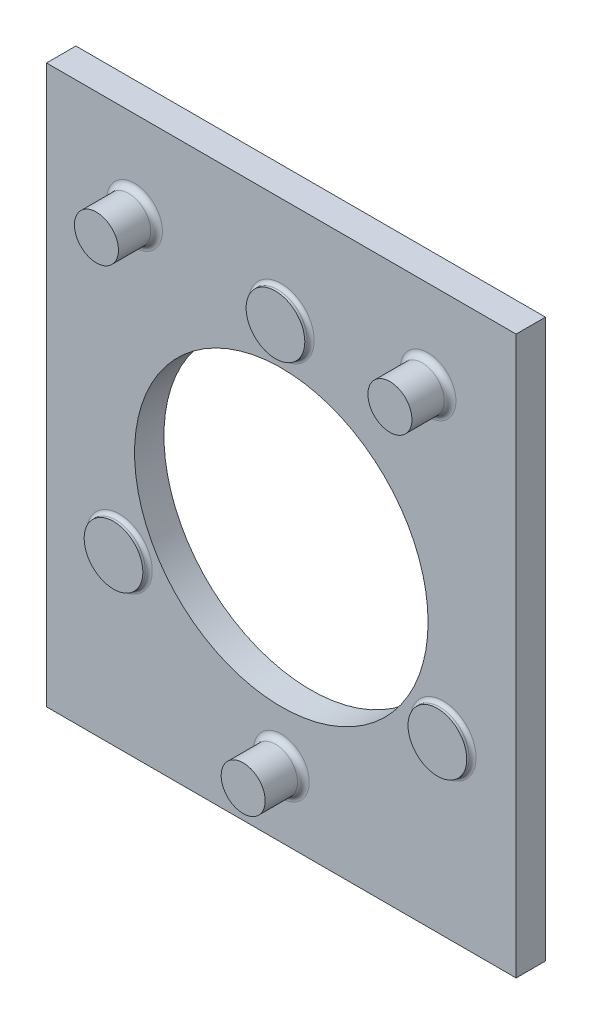
ISO-10303-21;
HEADER;
FILE_DESCRIPTION(('STEP AP214'),'2;1');
FILE_NAME('part.step','',(''),(''),'','','');
FILE_SCHEMA(('AUTOMOTIVE_DESIGN { 1 0 10303 214 1 1 1 1 }'));
ENDSEC;
DATA;
#1=APPLICATION_CONTEXT('core data for automotive mechanical design processes');
#2=APPLICATION_PROTOCOL_DEFINITION('international standard','automotive_design',2000,#1);
#3=PRODUCT_CONTEXT('',#1,'mechanical');
#4=PRODUCT('Part','Part','',(#3));
#5=PRODUCT_RELATED_PRODUCT_CATEGORY('part','',(#4));
#6=PRODUCT_DEFINITION_FORMATION('','',#4);
#7=PRODUCT_DEFINITION_CONTEXT('part definition',#1,'design');
#8=PRODUCT_DEFINITION('design','',#6,#7);
#9=PRODUCT_DEFINITION_SHAPE('','',#8);
#10=(LENGTH_UNIT() NAMED_UNIT(*) SI_UNIT(.MILLI.,.METRE.));
#11=(NAMED_UNIT(*) PLANE_ANGLE_UNIT() SI_UNIT($,.RADIAN.));
#12=(NAMED_UNIT(*) SI_UNIT($,.STERADIAN.) SOLID_ANGLE_UNIT());
#13=UNCERTAINTY_MEASURE_WITH_UNIT(LENGTH_MEASURE(1.E-05),#10,'distance_accuracy_value','');
#14=(GEOMETRIC_REPRESENTATION_CONTEXT(3) GLOBAL_UNCERTAINTY_ASSIGNED_CONTEXT((#13)) GLOBAL_UNIT_ASSIGNED_CONTEXT((#10,
#11,#12)) REPRESENTATION_CONTEXT('',''));
#15=CARTESIAN_POINT('',(0.,0.,0.));
#16=DIRECTION('',(0.,0.,1.));
#17=DIRECTION('',(1.,0.,0.));
#18=AXIS2_PLACEMENT_3D('',#15,#16,#17);
#19=CARTESIAN_POINT('',(0.,241.3,12.7));
#20=DIRECTION('',(0.,0.,-1.));
#21=DIRECTION('',(-1.,0.,0.));
#22=AXIS2_PLACEMENT_3D('',#19,#20,#21);
#23=PLANE('',#22);
#24=CARTESIAN_POINT('',(101.6,195.212789493481,12.7));
#25=DIRECTION('',(0.,0.,-1.));
#26=DIRECTION('',(-1.,0.,0.));
#27=AXIS2_PLACEMENT_3D('',#24,#25,#26);
#28=CIRCLE('',#27,14.224);
#29=CARTESIAN_POINT('',(87.376,195.212789493481,12.7));
#30=VERTEX_POINT('',#29);
#31=EDGE_CURVE('E138',#30,#30,#28,.T.);
#32=ORIENTED_EDGE('',*,*,#31,.T.);
#33=EDGE_LOOP('',(#32));
#34=FACE_BOUND('',#33,.T.);
#35=CARTESIAN_POINT('',(171.672531192417,73.8436052532595,12.7));
#36=DIRECTION('',(0.,0.,-1.));
#37=DIRECTION('',(-1.,0.,0.));
#38=AXIS2_PLACEMENT_3D('',#35,#36,#37);
#39=CIRCLE('',#38,14.224);
#40=CARTESIAN_POINT('',(157.448531192417,73.8436052532595,12.7));
#41=VERTEX_POINT('',#40);
#42=EDGE_CURVE('E135',#41,#41,#39,.T.);
#43=ORIENTED_EDGE('',*,*,#42,.T.);
#44=EDGE_LOOP('',(#43));
#45=FACE_BOUND('',#44,.T.);
#46=CARTESIAN_POINT('',(31.527468807583,73.8436052532596,12.7));
#47=DIRECTION('',(0.,0.,-1.));
#48=DIRECTION('',(-1.,0.,0.));
#49=AXIS2_PLACEMENT_3D('',#46,#47,#48);
#50=CIRCLE('',#49,14.224);
#51=CARTESIAN_POINT('',(17.303468807583,73.8436052532596,12.7));
#52=VERTEX_POINT('',#51);
#53=EDGE_CURVE('E132',#52,#52,#50,.T.);
#54=ORIENTED_EDGE('',*,*,#53,.T.);
#55=EDGE_LOOP('',(#54));
#56=FACE_BOUND('',#55,.T.);
#57=CARTESIAN_POINT('',(38.1,203.2,12.7));
#58=DIRECTION('',(0.,0.,-1.));
#59=DIRECTION('',(-1.,0.,0.));
#60=AXIS2_PLACEMENT_3D('',#57,#58,#59);
#61=CIRCLE('',#60,12.065);
#62=CARTESIAN_POINT('',(26.035,203.2,12.7));
#63=VERTEX_POINT('',#62);
#64=EDGE_CURVE('E120',#63,#63,#61,.T.);
#65=ORIENTED_EDGE('',*,*,#64,.T.);
#66=EDGE_LOOP('',(#65));
#67=FACE_BOUND('',#66,.T.);
#68=CARTESIAN_POINT('',(165.1,203.2,12.7));
#69=DIRECTION('',(0.,0.,-1.));
#70=DIRECTION('',(-1.,0.,0.));
#71=AXIS2_PLACEMENT_3D('',#68,#69,#70);
#72=CIRCLE('',#71,12.065);
#73=CARTESIAN_POINT('',(153.035,203.2,12.7));
#74=VERTEX_POINT('',#73);
#75=EDGE_CURVE('E117',#74,#74,#72,.T.);
#76=ORIENTED_EDGE('',*,*,#75,.T.);
#77=EDGE_LOOP('',(#76));
#78=FACE_BOUND('',#77,.T.);
#79=CARTESIAN_POINT('',(101.6,28.575,12.7));
#80=DIRECTION('',(0.,0.,-1.));
#81=DIRECTION('',(-1.,0.,0.));
#82=AXIS2_PLACEMENT_3D('',#79,#80,#81);
#83=CIRCLE('',#82,12.065);
#84=CARTESIAN_POINT('',(89.535,28.575,12.7));
#85=VERTEX_POINT('',#84);
#86=EDGE_CURVE('E114',#85,#85,#83,.T.);
#87=ORIENTED_EDGE('',*,*,#86,.T.);
#88=EDGE_LOOP('',(#87));
#89=FACE_BOUND('',#88,.T.);
#90=DIRECTION('',(0.,-1.,0.));
#91=VECTOR('',#90,1.);
#92=CARTESIAN_POINT('',(0.,0.,12.7));
#93=LINE('',#92,#91);
#94=CARTESIAN_POINT('',(0.,241.3,12.7));
#95=VERTEX_POINT('',#94);
#96=CARTESIAN_POINT('',(0.,0.,12.7));
#97=VERTEX_POINT('',#96);
#98=EDGE_CURVE('E86',#95,#97,#93,.T.);
#99=ORIENTED_EDGE('',*,*,#98,.T.);
#100=DIRECTION('',(1.,0.,0.));
#101=VECTOR('',#100,1.);
#102=CARTESIAN_POINT('',(0.,0.,12.7));
#103=LINE('',#102,#101);
#104=CARTESIAN_POINT('',(203.2,0.,12.7));
#105=VERTEX_POINT('',#104);
#106=EDGE_CURVE('E81',#97,#105,#103,.T.);
#107=ORIENTED_EDGE('',*,*,#106,.T.);
#108=DIRECTION('',(0.,1.,0.));
#109=VECTOR('',#108,1.);
#110=CARTESIAN_POINT('',(203.2,0.,12.7));
#111=LINE('',#110,#109);
#112=CARTESIAN_POINT('',(203.2,241.3,12.7));
#113=VERTEX_POINT('',#112);
#114=EDGE_CURVE('E84',#105,#113,#111,.T.);
#115=ORIENTED_EDGE('',*,*,#114,.T.);
#116=DIRECTION('',(-1.,0.,0.));
#117=VECTOR('',#116,1.);
#118=CARTESIAN_POINT('',(0.,241.3,12.7));
#119=LINE('',#118,#117);
#120=EDGE_CURVE('E50',#113,#95,#119,.T.);
#121=ORIENTED_EDGE('',*,*,#120,.T.);
#122=EDGE_LOOP('',(#99,#107,#115,#121));
#123=FACE_BOUND('',#122,.T.);
#124=CARTESIAN_POINT('',(101.6,114.3,12.7));
#125=DIRECTION('',(0.,0.,1.));
#126=DIRECTION('',(1.,0.,0.));
#127=AXIS2_PLACEMENT_3D('',#124,#125,#126);
#128=CIRCLE('',#127,63.5);
#129=CARTESIAN_POINT('',(165.1,114.3,12.7));
#130=VERTEX_POINT('',#129);
#131=EDGE_CURVE('E104',#130,#130,#128,.T.);
#132=ORIENTED_EDGE('',*,*,#131,.F.);
#133=EDGE_LOOP('',(#132));
#134=FACE_BOUND('',#133,.T.);
#135=ADVANCED_FACE('F33',(#34,#45,#56,#67,#78,#89,#123,#134),#23,.F.);
#136=CARTESIAN_POINT('',(0.,241.3,0.));
#137=DIRECTION('',(0.,0.,-1.));
#138=DIRECTION('',(-1.,0.,0.));
#139=AXIS2_PLACEMENT_3D('',#136,#137,#138);
#140=PLANE('',#139);
#141=DIRECTION('',(0.,-1.,0.));
#142=VECTOR('',#141,1.);
#143=CARTESIAN_POINT('',(0.,0.,0.));
#144=LINE('',#143,#142);
#145=CARTESIAN_POINT('',(0.,241.3,0.));
#146=VERTEX_POINT('',#145);
#147=CARTESIAN_POINT('',(0.,0.,0.));
#148=VERTEX_POINT('',#147);
#149=EDGE_CURVE('E101',#146,#148,#144,.T.);
#150=ORIENTED_EDGE('',*,*,#149,.F.);
#151=DIRECTION('',(-1.,0.,0.));
#152=VECTOR('',#151,1.);
#153=CARTESIAN_POINT('',(0.,241.3,0.));
#154=LINE('',#153,#152);
#155=CARTESIAN_POINT('',(203.2,241.3,0.));
#156=VERTEX_POINT('',#155);
#157=EDGE_CURVE('E73',#156,#146,#154,.T.);
#158=ORIENTED_EDGE('',*,*,#157,.F.);
#159=DIRECTION('',(0.,1.,0.));
#160=VECTOR('',#159,1.);
#161=CARTESIAN_POINT('',(203.2,0.,0.));
#162=LINE('',#161,#160);
#163=CARTESIAN_POINT('',(203.2,0.,0.));
#164=VERTEX_POINT('',#163);
#165=EDGE_CURVE('E67',#164,#156,#162,.T.);
#166=ORIENTED_EDGE('',*,*,#165,.F.);
#167=DIRECTION('',(1.,0.,0.));
#168=VECTOR('',#167,1.);
#169=CARTESIAN_POINT('',(0.,0.,0.));
#170=LINE('',#169,#168);
#171=EDGE_CURVE('E91',#148,#164,#170,.T.);
#172=ORIENTED_EDGE('',*,*,#171,.F.);
#173=EDGE_LOOP('',(#150,#158,#166,#172));
#174=FACE_BOUND('',#173,.T.);
#175=CARTESIAN_POINT('',(101.6,114.3,0.));
#176=DIRECTION('',(0.,0.,1.));
#177=DIRECTION('',(1.,0.,0.));
#178=AXIS2_PLACEMENT_3D('',#175,#176,#177);
#179=CIRCLE('',#178,63.5);
#180=CARTESIAN_POINT('',(165.1,114.3,0.));
#181=VERTEX_POINT('',#180);
#182=EDGE_CURVE('E227',#181,#181,#179,.T.);
#183=ORIENTED_EDGE('',*,*,#182,.T.);
#184=EDGE_LOOP('',(#183));
#185=FACE_BOUND('',#184,.T.);
#186=ADVANCED_FACE('F160',(#174,#185),#140,.T.);
#187=CARTESIAN_POINT('',(0.,0.,12.7));
#188=DIRECTION('',(1.,0.,0.));
#189=DIRECTION('',(0.,0.,-1.));
#190=AXIS2_PLACEMENT_3D('',#187,#188,#189);
#191=PLANE('',#190);
#192=ORIENTED_EDGE('',*,*,#149,.T.);
#193=DIRECTION('',(0.,0.,-1.));
#194=VECTOR('',#193,1.);
#195=CARTESIAN_POINT('',(0.,0.,12.7));
#196=LINE('',#195,#194);
#197=EDGE_CURVE('E92',#97,#148,#196,.T.);
#198=ORIENTED_EDGE('',*,*,#197,.F.);
#199=ORIENTED_EDGE('',*,*,#98,.F.);
#200=DIRECTION('',(0.,0.,-1.));
#201=VECTOR('',#200,1.);
#202=CARTESIAN_POINT('',(0.,241.3,12.7));
#203=LINE('',#202,#201);
#204=EDGE_CURVE('E97',#95,#146,#203,.T.);
#205=ORIENTED_EDGE('',*,*,#204,.T.);
#206=EDGE_LOOP('',(#192,#198,#199,#205));
#207=FACE_BOUND('',#206,.T.);
#208=ADVANCED_FACE('F166',(#207),#191,.F.);
#209=CARTESIAN_POINT('',(0.,0.,12.7));
#210=DIRECTION('',(0.,1.,0.));
#211=DIRECTION('',(0.,0.,1.));
#212=AXIS2_PLACEMENT_3D('',#209,#210,#211);
#213=PLANE('',#212);
#214=ORIENTED_EDGE('',*,*,#171,.T.);
#215=DIRECTION('',(0.,0.,-1.));
#216=VECTOR('',#215,1.);
#217=CARTESIAN_POINT('',(203.2,0.,12.7));
#218=LINE('',#217,#216);
#219=EDGE_CURVE('E89',#105,#164,#218,.T.);
#220=ORIENTED_EDGE('',*,*,#219,.F.);
#221=ORIENTED_EDGE('',*,*,#106,.F.);
#222=ORIENTED_EDGE('',*,*,#197,.T.);
#223=EDGE_LOOP('',(#214,#220,#221,#222));
#224=FACE_BOUND('',#223,.T.);
#225=ADVANCED_FACE('F90',(#224),#213,.F.);
#226=CARTESIAN_POINT('',(203.2,0.,12.7));
#227=DIRECTION('',(-1.,0.,0.));
#228=DIRECTION('',(0.,0.,1.));
#229=AXIS2_PLACEMENT_3D('',#226,#227,#228);
#230=PLANE('',#229);
#231=ORIENTED_EDGE('',*,*,#165,.T.);
#232=DIRECTION('',(0.,0.,-1.));
#233=VECTOR('',#232,1.);
#234=CARTESIAN_POINT('',(203.2,241.3,12.7));
#235=LINE('',#234,#233);
#236=EDGE_CURVE('E93',#113,#156,#235,.T.);
#237=ORIENTED_EDGE('',*,*,#236,.F.);
#238=ORIENTED_EDGE('',*,*,#114,.F.);
#239=ORIENTED_EDGE('',*,*,#219,.T.);
#240=EDGE_LOOP('',(#231,#237,#238,#239));
#241=FACE_BOUND('',#240,.T.);
#242=ADVANCED_FACE('F95',(#241),#230,.F.);
#243=CARTESIAN_POINT('',(0.,241.3,12.7));
#244=DIRECTION('',(0.,-1.,0.));
#245=DIRECTION('',(0.,0.,-1.));
#246=AXIS2_PLACEMENT_3D('',#243,#244,#245);
#247=PLANE('',#246);
#248=ORIENTED_EDGE('',*,*,#157,.T.);
#249=ORIENTED_EDGE('',*,*,#204,.F.);
#250=ORIENTED_EDGE('',*,*,#120,.F.);
#251=ORIENTED_EDGE('',*,*,#236,.T.);
#252=EDGE_LOOP('',(#248,#249,#250,#251));
#253=FACE_BOUND('',#252,.T.);
#254=ADVANCED_FACE('F174',(#253),#247,.F.);
#255=CARTESIAN_POINT('',(101.6,114.3,12.7));
#256=DIRECTION('',(0.,0.,-1.));
#257=DIRECTION('',(-1.,0.,0.));
#258=AXIS2_PLACEMENT_3D('',#255,#256,#257);
#259=CYLINDRICAL_SURFACE('',#258,63.5);
#260=ORIENTED_EDGE('',*,*,#131,.T.);
#261=EDGE_LOOP('',(#260));
#262=FACE_BOUND('',#261,.T.);
#263=ORIENTED_EDGE('',*,*,#182,.F.);
#264=EDGE_LOOP('',(#263));
#265=FACE_BOUND('',#264,.T.);
#266=ADVANCED_FACE('F171',(#262,#265),#259,.F.);
#267=CARTESIAN_POINT('',(31.527468807583,73.8436052532596,15.24));
#268=DIRECTION('',(0.,0.,-1.));
#269=DIRECTION('',(-1.,0.,0.));
#270=AXIS2_PLACEMENT_3D('',#267,#268,#269);
#271=CYLINDRICAL_SURFACE('',#270,12.7);
#272=CARTESIAN_POINT('',(31.527468807583,73.8436052532596,14.224));
#273=DIRECTION('',(0.,0.,-1.));
#274=DIRECTION('',(-1.,0.,0.));
#275=AXIS2_PLACEMENT_3D('',#272,#273,#274);
#276=CIRCLE('',#275,12.7);
#277=CARTESIAN_POINT('',(18.827468807583,73.8436052532596,14.224));
#278=VERTEX_POINT('',#277);
#279=EDGE_CURVE('E11',#278,#278,#276,.F.);
#280=ORIENTED_EDGE('',*,*,#279,.T.);
#281=EDGE_LOOP('',(#280));
#282=FACE_BOUND('',#281,.T.);
#283=CARTESIAN_POINT('',(31.527468807583,73.8436052532596,15.24));
#284=DIRECTION('',(0.,0.,1.));
#285=DIRECTION('',(1.,0.,0.));
#286=AXIS2_PLACEMENT_3D('',#283,#284,#285);
#287=CIRCLE('',#286,12.7);
#288=CARTESIAN_POINT('',(44.227468807583,73.8436052532596,15.24));
#289=VERTEX_POINT('',#288);
#290=EDGE_CURVE('E224',#289,#289,#287,.T.);
#291=ORIENTED_EDGE('',*,*,#290,.F.);
#292=EDGE_LOOP('',(#291));
#293=FACE_BOUND('',#292,.T.);
#294=ADVANCED_FACE('F235',(#282,#293),#271,.T.);
#295=CARTESIAN_POINT('',(31.527468807583,73.8436052532596,15.24));
#296=DIRECTION('',(0.,0.,1.));
#297=DIRECTION('',(1.,0.,0.));
#298=AXIS2_PLACEMENT_3D('',#295,#296,#297);
#299=PLANE('',#298);
#300=ORIENTED_EDGE('',*,*,#290,.T.);
#301=EDGE_LOOP('',(#300));
#302=FACE_BOUND('',#301,.T.);
#303=ADVANCED_FACE('F240',(#302),#299,.T.);
#304=CARTESIAN_POINT('',(101.6,195.212789493481,15.24));
#305=DIRECTION('',(0.,0.,-1.));
#306=DIRECTION('',(-1.,0.,0.));
#307=AXIS2_PLACEMENT_3D('',#304,#305,#306);
#308=CYLINDRICAL_SURFACE('',#307,12.7);
#309=CARTESIAN_POINT('',(101.6,195.212789493481,14.224));
#310=DIRECTION('',(0.,0.,-1.));
#311=DIRECTION('',(-1.,0.,0.));
#312=AXIS2_PLACEMENT_3D('',#309,#310,#311);
#313=CIRCLE('',#312,12.7);
#314=CARTESIAN_POINT('',(88.9,195.212789493481,14.224));
#315=VERTEX_POINT('',#314);
#316=EDGE_CURVE('E129',#315,#315,#313,.F.);
#317=ORIENTED_EDGE('',*,*,#316,.T.);
#318=EDGE_LOOP('',(#317));
#319=FACE_BOUND('',#318,.T.);
#320=CARTESIAN_POINT('',(101.6,195.212789493481,15.24));
#321=DIRECTION('',(0.,0.,1.));
#322=DIRECTION('',(1.,0.,0.));
#323=AXIS2_PLACEMENT_3D('',#320,#321,#322);
#324=CIRCLE('',#323,12.7);
#325=CARTESIAN_POINT('',(114.3,195.212789493481,15.24));
#326=VERTEX_POINT('',#325);
#327=EDGE_CURVE('E221',#326,#326,#324,.T.);
#328=ORIENTED_EDGE('',*,*,#327,.F.);
#329=EDGE_LOOP('',(#328));
#330=FACE_BOUND('',#329,.T.);
#331=ADVANCED_FACE('F246',(#319,#330),#308,.T.);
#332=CARTESIAN_POINT('',(101.6,195.212789493481,15.24));
#333=DIRECTION('',(0.,0.,1.));
#334=DIRECTION('',(1.,0.,0.));
#335=AXIS2_PLACEMENT_3D('',#332,#333,#334);
#336=PLANE('',#335);
#337=ORIENTED_EDGE('',*,*,#327,.T.);
#338=EDGE_LOOP('',(#337));
#339=FACE_BOUND('',#338,.T.);
#340=ADVANCED_FACE('F253',(#339),#336,.T.);
#341=CARTESIAN_POINT('',(171.672531192417,73.8436052532595,15.24));
#342=DIRECTION('',(0.,0.,-1.));
#343=DIRECTION('',(-1.,0.,0.));
#344=AXIS2_PLACEMENT_3D('',#341,#342,#343);
#345=CYLINDRICAL_SURFACE('',#344,12.7);
#346=CARTESIAN_POINT('',(171.672531192417,73.8436052532595,14.224));
#347=DIRECTION('',(0.,0.,-1.));
#348=DIRECTION('',(-1.,0.,0.));
#349=AXIS2_PLACEMENT_3D('',#346,#347,#348);
#350=CIRCLE('',#349,12.7);
#351=CARTESIAN_POINT('',(158.972531192417,73.8436052532595,14.224));
#352=VERTEX_POINT('',#351);
#353=EDGE_CURVE('E42',#352,#352,#350,.F.);
#354=ORIENTED_EDGE('',*,*,#353,.T.);
#355=EDGE_LOOP('',(#354));
#356=FACE_BOUND('',#355,.T.);
#357=CARTESIAN_POINT('',(171.672531192417,73.8436052532595,15.24));
#358=DIRECTION('',(0.,0.,1.));
#359=DIRECTION('',(1.,0.,0.));
#360=AXIS2_PLACEMENT_3D('',#357,#358,#359);
#361=CIRCLE('',#360,12.7);
#362=CARTESIAN_POINT('',(184.372531192417,73.8436052532595,15.24));
#363=VERTEX_POINT('',#362);
#364=EDGE_CURVE('E218',#363,#363,#361,.T.);
#365=ORIENTED_EDGE('',*,*,#364,.F.);
#366=EDGE_LOOP('',(#365));
#367=FACE_BOUND('',#366,.T.);
#368=ADVANCED_FACE('F143',(#356,#367),#345,.T.);
#369=CARTESIAN_POINT('',(171.672531192417,73.8436052532595,15.24));
#370=DIRECTION('',(0.,0.,1.));
#371=DIRECTION('',(1.,0.,0.));
#372=AXIS2_PLACEMENT_3D('',#369,#370,#371);
#373=PLANE('',#372);
#374=ORIENTED_EDGE('',*,*,#364,.T.);
#375=EDGE_LOOP('',(#374));
#376=FACE_BOUND('',#375,.T.);
#377=ADVANCED_FACE('F260',(#376),#373,.T.);
#378=CARTESIAN_POINT('',(38.1,203.2,29.21));
#379=DIRECTION('',(0.,0.,-1.));
#380=DIRECTION('',(-1.,0.,0.));
#381=AXIS2_PLACEMENT_3D('',#378,#379,#380);
#382=CYLINDRICAL_SURFACE('',#381,9.525);
#383=CARTESIAN_POINT('',(38.1,203.2,15.24));
#384=DIRECTION('',(0.,0.,-1.));
#385=DIRECTION('',(-1.,0.,0.));
#386=AXIS2_PLACEMENT_3D('',#383,#384,#385);
#387=CIRCLE('',#386,9.525);
#388=CARTESIAN_POINT('',(28.575,203.2,15.24));
#389=VERTEX_POINT('',#388);
#390=EDGE_CURVE('E111',#389,#389,#387,.F.);
#391=ORIENTED_EDGE('',*,*,#390,.T.);
#392=EDGE_LOOP('',(#391));
#393=FACE_BOUND('',#392,.T.);
#394=CARTESIAN_POINT('',(38.1,203.2,29.21));
#395=DIRECTION('',(0.,0.,1.));
#396=DIRECTION('',(1.,0.,0.));
#397=AXIS2_PLACEMENT_3D('',#394,#395,#396);
#398=CIRCLE('',#397,9.525);
#399=CARTESIAN_POINT('',(47.625,203.2,29.21));
#400=VERTEX_POINT('',#399);
#401=EDGE_CURVE('E213',#400,#400,#398,.T.);
#402=ORIENTED_EDGE('',*,*,#401,.F.);
#403=EDGE_LOOP('',(#402));
#404=FACE_BOUND('',#403,.T.);
#405=ADVANCED_FACE('F263',(#393,#404),#382,.T.);
#406=CARTESIAN_POINT('',(38.1,203.2,29.21));
#407=DIRECTION('',(0.,0.,1.));
#408=DIRECTION('',(1.,0.,0.));
#409=AXIS2_PLACEMENT_3D('',#406,#407,#408);
#410=PLANE('',#409);
#411=ORIENTED_EDGE('',*,*,#401,.T.);
#412=EDGE_LOOP('',(#411));
#413=FACE_BOUND('',#412,.T.);
#414=ADVANCED_FACE('F267',(#413),#410,.T.);
#415=CARTESIAN_POINT('',(165.1,203.2,29.21));
#416=DIRECTION('',(0.,0.,-1.));
#417=DIRECTION('',(-1.,0.,0.));
#418=AXIS2_PLACEMENT_3D('',#415,#416,#417);
#419=CYLINDRICAL_SURFACE('',#418,9.52499999999999);
#420=CARTESIAN_POINT('',(165.1,203.2,15.24));
#421=DIRECTION('',(0.,0.,-1.));
#422=DIRECTION('',(-1.,0.,0.));
#423=AXIS2_PLACEMENT_3D('',#420,#421,#422);
#424=CIRCLE('',#423,9.52499999999999);
#425=CARTESIAN_POINT('',(155.575,203.2,15.24));
#426=VERTEX_POINT('',#425);
#427=EDGE_CURVE('E123',#426,#426,#424,.F.);
#428=ORIENTED_EDGE('',*,*,#427,.T.);
#429=EDGE_LOOP('',(#428));
#430=FACE_BOUND('',#429,.T.);
#431=CARTESIAN_POINT('',(165.1,203.2,29.21));
#432=DIRECTION('',(0.,0.,1.));
#433=DIRECTION('',(1.,0.,0.));
#434=AXIS2_PLACEMENT_3D('',#431,#432,#433);
#435=CIRCLE('',#434,9.52499999999999);
#436=CARTESIAN_POINT('',(174.625,203.2,29.21));
#437=VERTEX_POINT('',#436);
#438=EDGE_CURVE('E210',#437,#437,#435,.T.);
#439=ORIENTED_EDGE('',*,*,#438,.F.);
#440=EDGE_LOOP('',(#439));
#441=FACE_BOUND('',#440,.T.);
#442=ADVANCED_FACE('F271',(#430,#441),#419,.T.);
#443=CARTESIAN_POINT('',(165.1,203.2,29.21));
#444=DIRECTION('',(0.,0.,1.));
#445=DIRECTION('',(1.,0.,0.));
#446=AXIS2_PLACEMENT_3D('',#443,#444,#445);
#447=PLANE('',#446);
#448=ORIENTED_EDGE('',*,*,#438,.T.);
#449=EDGE_LOOP('',(#448));
#450=FACE_BOUND('',#449,.T.);
#451=ADVANCED_FACE('F204',(#450),#447,.T.);
#452=CARTESIAN_POINT('',(101.6,28.575,29.21));
#453=DIRECTION('',(0.,0.,-1.));
#454=DIRECTION('',(-1.,0.,0.));
#455=AXIS2_PLACEMENT_3D('',#452,#453,#454);
#456=CYLINDRICAL_SURFACE('',#455,9.52500000000001);
#457=CARTESIAN_POINT('',(101.6,28.575,15.24));
#458=DIRECTION('',(0.,0.,-1.));
#459=DIRECTION('',(-1.,0.,0.));
#460=AXIS2_PLACEMENT_3D('',#457,#458,#459);
#461=CIRCLE('',#460,9.52500000000001);
#462=CARTESIAN_POINT('',(92.075,28.575,15.24));
#463=VERTEX_POINT('',#462);
#464=EDGE_CURVE('E126',#463,#463,#461,.F.);
#465=ORIENTED_EDGE('',*,*,#464,.T.);
#466=EDGE_LOOP('',(#465));
#467=FACE_BOUND('',#466,.T.);
#468=CARTESIAN_POINT('',(101.6,28.575,29.21));
#469=DIRECTION('',(0.,0.,1.));
#470=DIRECTION('',(1.,0.,0.));
#471=AXIS2_PLACEMENT_3D('',#468,#469,#470);
#472=CIRCLE('',#471,9.52500000000001);
#473=CARTESIAN_POINT('',(111.125,28.575,29.21));
#474=VERTEX_POINT('',#473);
#475=EDGE_CURVE('E208',#474,#474,#472,.T.);
#476=ORIENTED_EDGE('',*,*,#475,.F.);
#477=EDGE_LOOP('',(#476));
#478=FACE_BOUND('',#477,.T.);
#479=ADVANCED_FACE('F201',(#467,#478),#456,.T.);
#480=CARTESIAN_POINT('',(101.6,28.575,29.21));
#481=DIRECTION('',(0.,0.,1.));
#482=DIRECTION('',(1.,0.,0.));
#483=AXIS2_PLACEMENT_3D('',#480,#481,#482);
#484=PLANE('',#483);
#485=ORIENTED_EDGE('',*,*,#475,.T.);
#486=EDGE_LOOP('',(#485));
#487=FACE_BOUND('',#486,.T.);
#488=ADVANCED_FACE('F188',(#487),#484,.T.);
#489=CARTESIAN_POINT('',(38.1,203.2,15.24));
#490=DIRECTION('',(0.,0.,-1.));
#491=DIRECTION('',(-1.,0.,0.));
#492=AXIS2_PLACEMENT_3D('',#489,#490,#491);
#493=TOROIDAL_SURFACE('',#492,12.065,2.54);
#494=ORIENTED_EDGE('',*,*,#64,.F.);
#495=EDGE_LOOP('',(#494));
#496=FACE_BOUND('',#495,.T.);
#497=ORIENTED_EDGE('',*,*,#390,.F.);
#498=EDGE_LOOP('',(#497));
#499=FACE_BOUND('',#498,.T.);
#500=ADVANCED_FACE('F184',(#496,#499),#493,.F.);
#501=CARTESIAN_POINT('',(165.1,203.2,15.24));
#502=DIRECTION('',(0.,0.,-1.));
#503=DIRECTION('',(-1.,0.,0.));
#504=AXIS2_PLACEMENT_3D('',#501,#502,#503);
#505=TOROIDAL_SURFACE('',#504,12.065,2.54);
#506=ORIENTED_EDGE('',*,*,#75,.F.);
#507=EDGE_LOOP('',(#506));
#508=FACE_BOUND('',#507,.T.);
#509=ORIENTED_EDGE('',*,*,#427,.F.);
#510=EDGE_LOOP('',(#509));
#511=FACE_BOUND('',#510,.T.);
#512=ADVANCED_FACE('F187',(#508,#511),#505,.F.);
#513=CARTESIAN_POINT('',(101.6,28.575,15.24));
#514=DIRECTION('',(0.,0.,-1.));
#515=DIRECTION('',(-1.,0.,0.));
#516=AXIS2_PLACEMENT_3D('',#513,#514,#515);
#517=TOROIDAL_SURFACE('',#516,12.065,2.54);
#518=ORIENTED_EDGE('',*,*,#86,.F.);
#519=EDGE_LOOP('',(#518));
#520=FACE_BOUND('',#519,.T.);
#521=ORIENTED_EDGE('',*,*,#464,.F.);
#522=EDGE_LOOP('',(#521));
#523=FACE_BOUND('',#522,.T.);
#524=ADVANCED_FACE('F155',(#520,#523),#517,.F.);
#525=CARTESIAN_POINT('',(101.6,195.212789493481,14.224));
#526=DIRECTION('',(0.,0.,-1.));
#527=DIRECTION('',(-1.,0.,0.));
#528=AXIS2_PLACEMENT_3D('',#525,#526,#527);
#529=TOROIDAL_SURFACE('',#528,14.224,1.524);
#530=ORIENTED_EDGE('',*,*,#31,.F.);
#531=EDGE_LOOP('',(#530));
#532=FACE_BOUND('',#531,.T.);
#533=ORIENTED_EDGE('',*,*,#316,.F.);
#534=EDGE_LOOP('',(#533));
#535=FACE_BOUND('',#534,.T.);
#536=ADVANCED_FACE('F148',(#532,#535),#529,.F.);
#537=CARTESIAN_POINT('',(171.672531192417,73.8436052532595,14.224));
#538=DIRECTION('',(0.,0.,-1.));
#539=DIRECTION('',(-1.,0.,0.));
#540=AXIS2_PLACEMENT_3D('',#537,#538,#539);
#541=TOROIDAL_SURFACE('',#540,14.224,1.524);
#542=ORIENTED_EDGE('',*,*,#42,.F.);
#543=EDGE_LOOP('',(#542));
#544=FACE_BOUND('',#543,.T.);
#545=ORIENTED_EDGE('',*,*,#353,.F.);
#546=EDGE_LOOP('',(#545));
#547=FACE_BOUND('',#546,.T.);
#548=ADVANCED_FACE('F146',(#544,#547),#541,.F.);
#549=CARTESIAN_POINT('',(31.527468807583,73.8436052532596,14.224));
#550=DIRECTION('',(0.,0.,-1.));
#551=DIRECTION('',(-1.,0.,0.));
#552=AXIS2_PLACEMENT_3D('',#549,#550,#551);
#553=TOROIDAL_SURFACE('',#552,14.224,1.524);
#554=ORIENTED_EDGE('',*,*,#53,.F.);
#555=EDGE_LOOP('',(#554));
#556=FACE_BOUND('',#555,.T.);
#557=ORIENTED_EDGE('',*,*,#279,.F.);
#558=EDGE_LOOP('',(#557));
#559=FACE_BOUND('',#558,.T.);
#560=ADVANCED_FACE('F35',(#556,#559),#553,.F.);
#561=CLOSED_SHELL('',(#135,#186,#208,#225,#242,#254,#266,#294,#303,#331,#340,#368,#377,#405,
#414,#442,#451,#479,#488,#500,#512,#524,#536,#548,#560));
#562=MANIFOLD_SOLID_BREP('B2',#561);
#563=ADVANCED_BREP_SHAPE_REPRESENTATION('',(#18,#562),#14);
#564=SHAPE_DEFINITION_REPRESENTATION(#9,#563);
ENDSEC;
END-ISO-10303-21;
